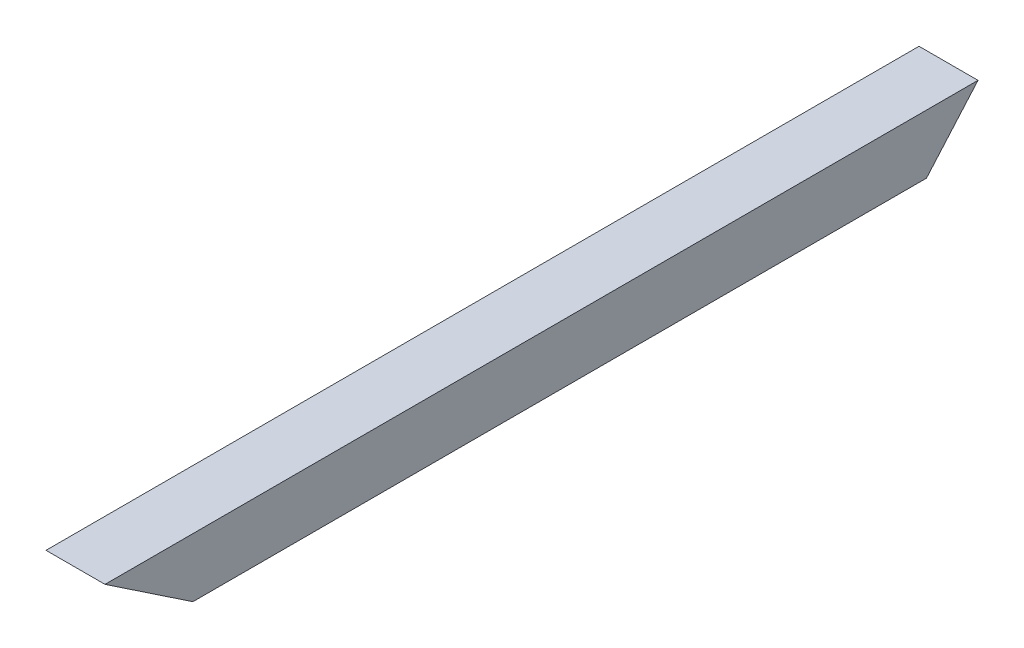
ISO-10303-21;
HEADER;
FILE_DESCRIPTION(('STEP AP214'),'2;1');
FILE_NAME('part.step','',(''),(''),'','','');
FILE_SCHEMA(('AUTOMOTIVE_DESIGN { 1 0 10303 214 1 1 1 1 }'));
ENDSEC;
DATA;
#1=APPLICATION_CONTEXT('core data for automotive mechanical design processes');
#2=APPLICATION_PROTOCOL_DEFINITION('international standard','automotive_design',2000,#1);
#3=PRODUCT_CONTEXT('',#1,'mechanical');
#4=PRODUCT('Part','Part','',(#3));
#5=PRODUCT_RELATED_PRODUCT_CATEGORY('part','',(#4));
#6=PRODUCT_DEFINITION_FORMATION('','',#4);
#7=PRODUCT_DEFINITION_CONTEXT('part definition',#1,'design');
#8=PRODUCT_DEFINITION('design','',#6,#7);
#9=PRODUCT_DEFINITION_SHAPE('','',#8);
#10=(LENGTH_UNIT() NAMED_UNIT(*) SI_UNIT(.MILLI.,.METRE.));
#11=(NAMED_UNIT(*) PLANE_ANGLE_UNIT() SI_UNIT($,.RADIAN.));
#12=(NAMED_UNIT(*) SI_UNIT($,.STERADIAN.) SOLID_ANGLE_UNIT());
#13=UNCERTAINTY_MEASURE_WITH_UNIT(LENGTH_MEASURE(1.E-05),#10,'distance_accuracy_value','');
#14=(GEOMETRIC_REPRESENTATION_CONTEXT(3) GLOBAL_UNCERTAINTY_ASSIGNED_CONTEXT((#13)) GLOBAL_UNIT_ASSIGNED_CONTEXT((#10,
#11,#12)) REPRESENTATION_CONTEXT('',''));
#15=CARTESIAN_POINT('',(0.,0.,0.));
#16=DIRECTION('',(0.,0.,1.));
#17=DIRECTION('',(1.,0.,0.));
#18=AXIS2_PLACEMENT_3D('',#15,#16,#17);
#19=CARTESIAN_POINT('',(-12.7,12.7,378.309162507599));
#20=DIRECTION('',(1.,0.,0.));
#21=DIRECTION('',(0.,0.,-1.));
#22=AXIS2_PLACEMENT_3D('',#19,#20,#21);
#23=PLANE('',#22);
#24=DIRECTION('',(0.,-0.557172610873234,-0.830396701398015));
#25=VECTOR('',#24,1.);
#26=CARTESIAN_POINT('',(-12.6999999999998,13.7896171737988,377.578060319265));
#27=LINE('',#26,#25);
#28=CARTESIAN_POINT('',(-12.6999999999998,12.7,375.954121006291));
#29=VERTEX_POINT('',#28);
#30=CARTESIAN_POINT('',(-12.6999999999998,-12.7,338.098569954611));
#31=VERTEX_POINT('',#30);
#32=EDGE_CURVE('E96',#29,#31,#27,.T.);
#33=ORIENTED_EDGE('',*,*,#32,.F.);
#34=DIRECTION('',(0.,0.,-1.));
#35=VECTOR('',#34,1.);
#36=CARTESIAN_POINT('',(-12.7,12.7,378.309162507599));
#37=LINE('',#36,#35);
#38=CARTESIAN_POINT('',(-12.7,12.7,0.));
#39=VERTEX_POINT('',#38);
#40=EDGE_CURVE('E106',#29,#39,#37,.T.);
#41=ORIENTED_EDGE('',*,*,#40,.T.);
#42=DIRECTION('',(0.,0.753109895855487,-0.657894736842101));
#43=VECTOR('',#42,1.);
#44=CARTESIAN_POINT('',(-12.7,12.7,0.));
#45=LINE('',#44,#43);
#46=CARTESIAN_POINT('',(-12.7,-12.7,22.1886957106137));
#47=VERTEX_POINT('',#46);
#48=EDGE_CURVE('E165',#47,#39,#45,.T.);
#49=ORIENTED_EDGE('',*,*,#48,.F.);
#50=DIRECTION('',(0.,0.,-1.));
#51=VECTOR('',#50,1.);
#52=CARTESIAN_POINT('',(-12.7,-12.7,378.309162507599));
#53=LINE('',#52,#51);
#54=EDGE_CURVE('E108',#31,#47,#53,.T.);
#55=ORIENTED_EDGE('',*,*,#54,.F.);
#56=EDGE_LOOP('',(#33,#41,#49,#55));
#57=FACE_BOUND('',#56,.T.);
#58=ADVANCED_FACE('F33',(#57),#23,.F.);
#59=CARTESIAN_POINT('',(12.7,-12.7,378.309162507599));
#60=DIRECTION('',(0.,1.,0.));
#61=DIRECTION('',(-1.,0.,0.));
#62=AXIS2_PLACEMENT_3D('',#59,#60,#61);
#63=PLANE('',#62);
#64=DIRECTION('',(1.,0.,0.));
#65=VECTOR('',#64,1.);
#66=CARTESIAN_POINT('',(12.7,-12.7,338.098569954611));
#67=LINE('',#66,#65);
#68=CARTESIAN_POINT('',(12.7000000000002,-12.7,338.098569954611));
#69=VERTEX_POINT('',#68);
#70=EDGE_CURVE('E101',#31,#69,#67,.T.);
#71=ORIENTED_EDGE('',*,*,#70,.F.);
#72=ORIENTED_EDGE('',*,*,#54,.T.);
#73=DIRECTION('',(1.,0.,0.));
#74=VECTOR('',#73,1.);
#75=CARTESIAN_POINT('',(12.6999999999999,-12.7,22.1886957106137));
#76=LINE('',#75,#74);
#77=CARTESIAN_POINT('',(12.7,-12.7,22.1886957106137));
#78=VERTEX_POINT('',#77);
#79=EDGE_CURVE('E143',#47,#78,#76,.T.);
#80=ORIENTED_EDGE('',*,*,#79,.T.);
#81=DIRECTION('',(0.,0.,-1.));
#82=VECTOR('',#81,1.);
#83=CARTESIAN_POINT('',(12.7,-12.7,378.309162507599));
#84=LINE('',#83,#82);
#85=EDGE_CURVE('E116',#69,#78,#84,.T.);
#86=ORIENTED_EDGE('',*,*,#85,.F.);
#87=EDGE_LOOP('',(#71,#72,#80,#86));
#88=FACE_BOUND('',#87,.T.);
#89=ADVANCED_FACE('F179',(#88),#63,.F.);
#90=CARTESIAN_POINT('',(12.7,12.7,378.309162507599));
#91=DIRECTION('',(-1.,0.,0.));
#92=DIRECTION('',(0.,-1.,0.));
#93=AXIS2_PLACEMENT_3D('',#90,#91,#92);
#94=PLANE('',#93);
#95=DIRECTION('',(0.,-0.557172610873234,-0.830396701398015));
#96=VECTOR('',#95,1.);
#97=CARTESIAN_POINT('',(12.7000000000002,13.7896171737988,377.578060319264));
#98=LINE('',#97,#96);
#99=CARTESIAN_POINT('',(12.7,12.7,375.954121006291));
#100=VERTEX_POINT('',#99);
#101=EDGE_CURVE('E47',#100,#69,#98,.T.);
#102=ORIENTED_EDGE('',*,*,#101,.T.);
#103=ORIENTED_EDGE('',*,*,#85,.T.);
#104=DIRECTION('',(0.,0.753109895855487,-0.657894736842101));
#105=VECTOR('',#104,1.);
#106=CARTESIAN_POINT('',(12.7,12.7,0.));
#107=LINE('',#106,#105);
#108=CARTESIAN_POINT('',(12.7,12.7,0.));
#109=VERTEX_POINT('',#108);
#110=EDGE_CURVE('E163',#78,#109,#107,.T.);
#111=ORIENTED_EDGE('',*,*,#110,.T.);
#112=DIRECTION('',(0.,0.,-1.));
#113=VECTOR('',#112,1.);
#114=CARTESIAN_POINT('',(12.7,12.7,378.309162507599));
#115=LINE('',#114,#113);
#116=EDGE_CURVE('E114',#100,#109,#115,.T.);
#117=ORIENTED_EDGE('',*,*,#116,.F.);
#118=EDGE_LOOP('',(#102,#103,#111,#117));
#119=FACE_BOUND('',#118,.T.);
#120=ADVANCED_FACE('F176',(#119),#94,.F.);
#121=CARTESIAN_POINT('',(12.7,12.7,378.309162507599));
#122=DIRECTION('',(0.,-1.,0.));
#123=DIRECTION('',(1.,0.,0.));
#124=AXIS2_PLACEMENT_3D('',#121,#122,#123);
#125=PLANE('',#124);
#126=DIRECTION('',(-1.,0.,0.));
#127=VECTOR('',#126,1.);
#128=CARTESIAN_POINT('',(12.7,12.7,375.954121006291));
#129=LINE('',#128,#127);
#130=EDGE_CURVE('E93',#100,#29,#129,.T.);
#131=ORIENTED_EDGE('',*,*,#130,.F.);
#132=ORIENTED_EDGE('',*,*,#116,.T.);
#133=DIRECTION('',(-1.,0.,0.));
#134=VECTOR('',#133,1.);
#135=CARTESIAN_POINT('',(12.7,12.7,0.));
#136=LINE('',#135,#134);
#137=EDGE_CURVE('E113',#109,#39,#136,.T.);
#138=ORIENTED_EDGE('',*,*,#137,.T.);
#139=ORIENTED_EDGE('',*,*,#40,.F.);
#140=EDGE_LOOP('',(#131,#132,#138,#139));
#141=FACE_BOUND('',#140,.T.);
#142=ADVANCED_FACE('F111',(#141),#125,.F.);
#143=CARTESIAN_POINT('',(-11.049,11.049,378.309162507599));
#144=DIRECTION('',(1.,0.,0.));
#145=DIRECTION('',(0.,1.,0.));
#146=AXIS2_PLACEMENT_3D('',#143,#144,#145);
#147=PLANE('',#146);
#148=DIRECTION('',(0.,0.,-1.));
#149=VECTOR('',#148,1.);
#150=CARTESIAN_POINT('',(-11.049,11.049,378.309162507599));
#151=LINE('',#150,#149);
#152=CARTESIAN_POINT('',(-11.049,11.049,373.493510187932));
#153=VERTEX_POINT('',#152);
#154=CARTESIAN_POINT('',(-11.049,11.049,1.4422652211899));
#155=VERTEX_POINT('',#154);
#156=EDGE_CURVE('E141',#153,#155,#151,.T.);
#157=ORIENTED_EDGE('',*,*,#156,.F.);
#158=DIRECTION('',(0.,-0.557172610873234,-0.830396701398015));
#159=VECTOR('',#158,1.);
#160=CARTESIAN_POINT('',(-11.049,13.2770785572734,376.814185052972));
#161=LINE('',#160,#159);
#162=CARTESIAN_POINT('',(-11.049,-11.049,340.55918077297));
#163=VERTEX_POINT('',#162);
#164=EDGE_CURVE('E55',#153,#163,#161,.T.);
#165=ORIENTED_EDGE('',*,*,#164,.T.);
#166=DIRECTION('',(0.,0.,-1.));
#167=VECTOR('',#166,1.);
#168=CARTESIAN_POINT('',(-11.049,-11.049,378.309162507599));
#169=LINE('',#168,#167);
#170=CARTESIAN_POINT('',(-11.049,-11.049,20.7464304894238));
#171=VERTEX_POINT('',#170);
#172=EDGE_CURVE('E118',#163,#171,#169,.T.);
#173=ORIENTED_EDGE('',*,*,#172,.T.);
#174=DIRECTION('',(0.,-0.753109895855487,0.657894736842101));
#175=VECTOR('',#174,1.);
#176=CARTESIAN_POINT('',(-11.049,-175.676124846544,164.559862730887));
#177=LINE('',#176,#175);
#178=EDGE_CURVE('E132',#155,#171,#177,.T.);
#179=ORIENTED_EDGE('',*,*,#178,.F.);
#180=EDGE_LOOP('',(#157,#165,#173,#179));
#181=FACE_BOUND('',#180,.T.);
#182=ADVANCED_FACE('F140',(#181),#147,.T.);
#183=CARTESIAN_POINT('',(11.049,-11.049,378.309162507599));
#184=DIRECTION('',(0.,1.,0.));
#185=DIRECTION('',(-1.,0.,0.));
#186=AXIS2_PLACEMENT_3D('',#183,#184,#185);
#187=PLANE('',#186);
#188=ORIENTED_EDGE('',*,*,#172,.F.);
#189=DIRECTION('',(1.,0.,0.));
#190=VECTOR('',#189,1.);
#191=CARTESIAN_POINT('',(11.049,-11.049,340.55918077297));
#192=LINE('',#191,#190);
#193=CARTESIAN_POINT('',(11.049,-11.049,340.55918077297));
#194=VERTEX_POINT('',#193);
#195=EDGE_CURVE('E159',#163,#194,#192,.T.);
#196=ORIENTED_EDGE('',*,*,#195,.T.);
#197=DIRECTION('',(0.,0.,-1.));
#198=VECTOR('',#197,1.);
#199=CARTESIAN_POINT('',(11.049,-11.049,378.309162507599));
#200=LINE('',#199,#198);
#201=CARTESIAN_POINT('',(11.049,-11.049,20.7464304894238));
#202=VERTEX_POINT('',#201);
#203=EDGE_CURVE('E154',#194,#202,#200,.T.);
#204=ORIENTED_EDGE('',*,*,#203,.T.);
#205=DIRECTION('',(1.,0.,0.));
#206=VECTOR('',#205,1.);
#207=CARTESIAN_POINT('',(11.0489999999999,-11.049,20.7464304894238));
#208=LINE('',#207,#206);
#209=EDGE_CURVE('E144',#171,#202,#208,.T.);
#210=ORIENTED_EDGE('',*,*,#209,.F.);
#211=EDGE_LOOP('',(#188,#196,#204,#210));
#212=FACE_BOUND('',#211,.T.);
#213=ADVANCED_FACE('F158',(#212),#187,.T.);
#214=CARTESIAN_POINT('',(11.049,11.049,378.309162507599));
#215=DIRECTION('',(-1.,0.,0.));
#216=DIRECTION('',(0.,-1.,0.));
#217=AXIS2_PLACEMENT_3D('',#214,#215,#216);
#218=PLANE('',#217);
#219=ORIENTED_EDGE('',*,*,#203,.F.);
#220=DIRECTION('',(0.,0.557172610873234,0.830396701398015));
#221=VECTOR('',#220,1.);
#222=CARTESIAN_POINT('',(11.049,13.2770785572734,376.814185052972));
#223=LINE('',#222,#221);
#224=CARTESIAN_POINT('',(11.049,11.049,373.493510187932));
#225=VERTEX_POINT('',#224);
#226=EDGE_CURVE('E172',#194,#225,#223,.T.);
#227=ORIENTED_EDGE('',*,*,#226,.T.);
#228=DIRECTION('',(0.,0.,-1.));
#229=VECTOR('',#228,1.);
#230=CARTESIAN_POINT('',(11.049,11.049,378.309162507599));
#231=LINE('',#230,#229);
#232=CARTESIAN_POINT('',(11.049,11.049,1.4422652211899));
#233=VERTEX_POINT('',#232);
#234=EDGE_CURVE('E152',#225,#233,#231,.T.);
#235=ORIENTED_EDGE('',*,*,#234,.T.);
#236=DIRECTION('',(0.,0.753109895855487,-0.657894736842101));
#237=VECTOR('',#236,1.);
#238=CARTESIAN_POINT('',(11.049,-175.676124846544,164.559862730887));
#239=LINE('',#238,#237);
#240=EDGE_CURVE('E135',#202,#233,#239,.T.);
#241=ORIENTED_EDGE('',*,*,#240,.F.);
#242=EDGE_LOOP('',(#219,#227,#235,#241));
#243=FACE_BOUND('',#242,.T.);
#244=ADVANCED_FACE('F162',(#243),#218,.T.);
#245=CARTESIAN_POINT('',(11.049,11.049,378.309162507599));
#246=DIRECTION('',(0.,-1.,0.));
#247=DIRECTION('',(1.,0.,0.));
#248=AXIS2_PLACEMENT_3D('',#245,#246,#247);
#249=PLANE('',#248);
#250=ORIENTED_EDGE('',*,*,#234,.F.);
#251=DIRECTION('',(-1.,0.,0.));
#252=VECTOR('',#251,1.);
#253=CARTESIAN_POINT('',(11.049,11.049,373.493510187932));
#254=LINE('',#253,#252);
#255=EDGE_CURVE('E11',#225,#153,#254,.T.);
#256=ORIENTED_EDGE('',*,*,#255,.T.);
#257=ORIENTED_EDGE('',*,*,#156,.T.);
#258=DIRECTION('',(-1.,0.,0.));
#259=VECTOR('',#258,1.);
#260=CARTESIAN_POINT('',(11.0489999999999,11.049,1.4422652211899));
#261=LINE('',#260,#259);
#262=EDGE_CURVE('E40',#233,#155,#261,.T.);
#263=ORIENTED_EDGE('',*,*,#262,.F.);
#264=EDGE_LOOP('',(#250,#256,#257,#263));
#265=FACE_BOUND('',#264,.T.);
#266=ADVANCED_FACE('F182',(#265),#249,.T.);
#267=CARTESIAN_POINT('',(12.7,12.7,0.));
#268=DIRECTION('',(0.,0.657894736842101,0.753109895855487));
#269=DIRECTION('',(0.,-0.753109895855487,0.657894736842101));
#270=AXIS2_PLACEMENT_3D('',#267,#268,#269);
#271=PLANE('',#270);
#272=ORIENTED_EDGE('',*,*,#178,.T.);
#273=ORIENTED_EDGE('',*,*,#209,.T.);
#274=ORIENTED_EDGE('',*,*,#240,.T.);
#275=ORIENTED_EDGE('',*,*,#262,.T.);
#276=EDGE_LOOP('',(#272,#273,#274,#275));
#277=FACE_BOUND('',#276,.T.);
#278=ORIENTED_EDGE('',*,*,#48,.T.);
#279=ORIENTED_EDGE('',*,*,#137,.F.);
#280=ORIENTED_EDGE('',*,*,#110,.F.);
#281=ORIENTED_EDGE('',*,*,#79,.F.);
#282=EDGE_LOOP('',(#278,#279,#280,#281));
#283=FACE_BOUND('',#282,.T.);
#284=ADVANCED_FACE('F129',(#277,#283),#271,.F.);
#285=CARTESIAN_POINT('',(-12.6999999999998,13.7896171737988,377.578060319265));
#286=DIRECTION('',(0.,-0.830396701398015,0.557172610873234));
#287=DIRECTION('',(0.,-0.557172610873234,-0.830396701398015));
#288=AXIS2_PLACEMENT_3D('',#285,#286,#287);
#289=PLANE('',#288);
#290=ORIENTED_EDGE('',*,*,#255,.F.);
#291=ORIENTED_EDGE('',*,*,#226,.F.);
#292=ORIENTED_EDGE('',*,*,#195,.F.);
#293=ORIENTED_EDGE('',*,*,#164,.F.);
#294=EDGE_LOOP('',(#290,#291,#292,#293));
#295=FACE_BOUND('',#294,.T.);
#296=ORIENTED_EDGE('',*,*,#70,.T.);
#297=ORIENTED_EDGE('',*,*,#101,.F.);
#298=ORIENTED_EDGE('',*,*,#130,.T.);
#299=ORIENTED_EDGE('',*,*,#32,.T.);
#300=EDGE_LOOP('',(#296,#297,#298,#299));
#301=FACE_BOUND('',#300,.T.);
#302=ADVANCED_FACE('F95',(#295,#301),#289,.T.);
#303=CLOSED_SHELL('',(#58,#89,#120,#142,#182,#213,#244,#266,#284,#302));
#304=MANIFOLD_SOLID_BREP('B2',#303);
#305=ADVANCED_BREP_SHAPE_REPRESENTATION('',(#18,#304),#14);
#306=SHAPE_DEFINITION_REPRESENTATION(#9,#305);
ENDSEC;
END-ISO-10303-21;
